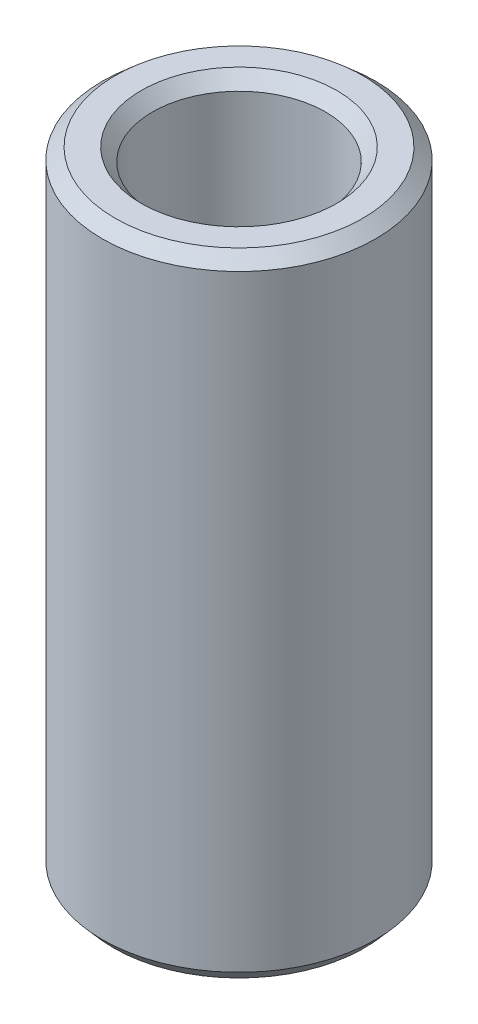
ISO-10303-21;
HEADER;
FILE_DESCRIPTION(('STEP AP214'),'2;1');
FILE_NAME('part.step','',(''),(''),'','','');
FILE_SCHEMA(('AUTOMOTIVE_DESIGN { 1 0 10303 214 1 1 1 1 }'));
ENDSEC;
DATA;
#1=APPLICATION_CONTEXT('core data for automotive mechanical design processes');
#2=APPLICATION_PROTOCOL_DEFINITION('international standard','automotive_design',2000,#1);
#3=PRODUCT_CONTEXT('',#1,'mechanical');
#4=PRODUCT('Part','Part','',(#3));
#5=PRODUCT_RELATED_PRODUCT_CATEGORY('part','',(#4));
#6=PRODUCT_DEFINITION_FORMATION('','',#4);
#7=PRODUCT_DEFINITION_CONTEXT('part definition',#1,'design');
#8=PRODUCT_DEFINITION('design','',#6,#7);
#9=PRODUCT_DEFINITION_SHAPE('','',#8);
#10=(LENGTH_UNIT() NAMED_UNIT(*) SI_UNIT(.MILLI.,.METRE.));
#11=(NAMED_UNIT(*) PLANE_ANGLE_UNIT() SI_UNIT($,.RADIAN.));
#12=(NAMED_UNIT(*) SI_UNIT($,.STERADIAN.) SOLID_ANGLE_UNIT());
#13=UNCERTAINTY_MEASURE_WITH_UNIT(LENGTH_MEASURE(1.E-05),#10,'distance_accuracy_value','');
#14=(GEOMETRIC_REPRESENTATION_CONTEXT(3) GLOBAL_UNCERTAINTY_ASSIGNED_CONTEXT((#13)) GLOBAL_UNIT_ASSIGNED_CONTEXT((#10,
#11,#12)) REPRESENTATION_CONTEXT('',''));
#15=CARTESIAN_POINT('',(0.,0.,0.));
#16=DIRECTION('',(0.,0.,1.));
#17=DIRECTION('',(1.,0.,0.));
#18=AXIS2_PLACEMENT_3D('',#15,#16,#17);
#19=CARTESIAN_POINT('',(0.,219.440858252176,0.));
#20=DIRECTION('',(0.,-1.,0.));
#21=DIRECTION('',(0.,0.,-1.));
#22=AXIS2_PLACEMENT_3D('',#19,#20,#21);
#23=CYLINDRICAL_SURFACE('',#22,47.5);
#24=CARTESIAN_POINT('',(0.,4.4820661124276,0.));
#25=DIRECTION('',(0.,1.,0.));
#26=DIRECTION('',(0.,0.,1.));
#27=AXIS2_PLACEMENT_3D('',#24,#25,#26);
#28=CIRCLE('',#27,47.5);
#29=CARTESIAN_POINT('',(0.,4.4820661124276,47.5));
#30=VERTEX_POINT('',#29);
#31=EDGE_CURVE('E10',#30,#30,#28,.T.);
#32=ORIENTED_EDGE('',*,*,#31,.T.);
#33=EDGE_LOOP('',(#32));
#34=FACE_BOUND('',#33,.T.);
#35=CARTESIAN_POINT('',(0.,215.505596652666,0.));
#36=DIRECTION('',(0.,1.,0.));
#37=DIRECTION('',(0.,0.,1.));
#38=AXIS2_PLACEMENT_3D('',#35,#36,#37);
#39=CIRCLE('',#38,47.5);
#40=CARTESIAN_POINT('',(0.,215.505596652666,47.5));
#41=VERTEX_POINT('',#40);
#42=EDGE_CURVE('E50',#41,#41,#39,.F.);
#43=ORIENTED_EDGE('',*,*,#42,.T.);
#44=EDGE_LOOP('',(#43));
#45=FACE_BOUND('',#44,.T.);
#46=ADVANCED_FACE('F39',(#34,#45),#23,.T.);
#47=CARTESIAN_POINT('',(0.,219.440858252176,0.));
#48=DIRECTION('',(0.,1.,0.));
#49=DIRECTION('',(0.,0.,1.));
#50=AXIS2_PLACEMENT_3D('',#47,#48,#49);
#51=PLANE('',#50);
#52=CARTESIAN_POINT('',(0.,219.440858252176,0.));
#53=DIRECTION('',(0.,1.,0.));
#54=DIRECTION('',(0.,0.,1.));
#55=AXIS2_PLACEMENT_3D('',#52,#53,#54);
#56=CIRCLE('',#55,34.0138644032273);
#57=CARTESIAN_POINT('',(0.,219.440858252176,34.0138644032273));
#58=VERTEX_POINT('',#57);
#59=EDGE_CURVE('E58',#58,#58,#56,.F.);
#60=ORIENTED_EDGE('',*,*,#59,.T.);
#61=EDGE_LOOP('',(#60));
#62=FACE_BOUND('',#61,.T.);
#63=CARTESIAN_POINT('',(0.,219.440858252176,0.));
#64=DIRECTION('',(0.,1.,0.));
#65=DIRECTION('',(0.,0.,1.));
#66=AXIS2_PLACEMENT_3D('',#63,#64,#65);
#67=CIRCLE('',#66,43.0179338875724);
#68=CARTESIAN_POINT('',(0.,219.440858252176,43.0179338875724));
#69=VERTEX_POINT('',#68);
#70=EDGE_CURVE('E61',#69,#69,#67,.T.);
#71=ORIENTED_EDGE('',*,*,#70,.T.);
#72=EDGE_LOOP('',(#71));
#73=FACE_BOUND('',#72,.T.);
#74=ADVANCED_FACE('F88',(#62,#73),#51,.T.);
#75=CARTESIAN_POINT('',(0.,0.,0.));
#76=DIRECTION('',(0.,1.,0.));
#77=DIRECTION('',(0.,0.,1.));
#78=AXIS2_PLACEMENT_3D('',#75,#76,#77);
#79=PLANE('',#78);
#80=CARTESIAN_POINT('',(0.,0.,0.));
#81=DIRECTION('',(0.,1.,0.));
#82=DIRECTION('',(0.,0.,1.));
#83=AXIS2_PLACEMENT_3D('',#80,#81,#82);
#84=CIRCLE('',#83,34.5606689161448);
#85=CARTESIAN_POINT('',(0.,0.,34.5606689161448));
#86=VERTEX_POINT('',#85);
#87=EDGE_CURVE('E51',#86,#86,#84,.T.);
#88=ORIENTED_EDGE('',*,*,#87,.T.);
#89=EDGE_LOOP('',(#88));
#90=FACE_BOUND('',#89,.T.);
#91=CARTESIAN_POINT('',(0.,0.,0.));
#92=DIRECTION('',(0.,1.,0.));
#93=DIRECTION('',(0.,0.,1.));
#94=AXIS2_PLACEMENT_3D('',#91,#92,#93);
#95=CIRCLE('',#94,43.5647384004899);
#96=CARTESIAN_POINT('',(0.,0.,43.5647384004899));
#97=VERTEX_POINT('',#96);
#98=EDGE_CURVE('E54',#97,#97,#95,.F.);
#99=ORIENTED_EDGE('',*,*,#98,.T.);
#100=EDGE_LOOP('',(#99));
#101=FACE_BOUND('',#100,.T.);
#102=ADVANCED_FACE('F83',(#90,#101),#79,.F.);
#103=CARTESIAN_POINT('',(0.,219.440858252176,0.));
#104=DIRECTION('',(0.,-1.,0.));
#105=DIRECTION('',(0.,0.,-1.));
#106=AXIS2_PLACEMENT_3D('',#103,#104,#105);
#107=CYLINDRICAL_SURFACE('',#106,30.0786028037172);
#108=CARTESIAN_POINT('',(0.,214.958792139749,0.));
#109=DIRECTION('',(0.,1.,0.));
#110=DIRECTION('',(0.,0.,1.));
#111=AXIS2_PLACEMENT_3D('',#108,#109,#110);
#112=CIRCLE('',#111,30.0786028037172);
#113=CARTESIAN_POINT('',(0.,214.958792139749,30.0786028037172));
#114=VERTEX_POINT('',#113);
#115=EDGE_CURVE('E67',#114,#114,#112,.T.);
#116=ORIENTED_EDGE('',*,*,#115,.T.);
#117=EDGE_LOOP('',(#116));
#118=FACE_BOUND('',#117,.T.);
#119=CARTESIAN_POINT('',(0.,3.93526159951008,0.));
#120=DIRECTION('',(0.,1.,0.));
#121=DIRECTION('',(0.,0.,1.));
#122=AXIS2_PLACEMENT_3D('',#119,#120,#121);
#123=CIRCLE('',#122,30.0786028037172);
#124=CARTESIAN_POINT('',(0.,3.93526159951008,30.0786028037172));
#125=VERTEX_POINT('',#124);
#126=EDGE_CURVE('E69',#125,#125,#123,.F.);
#127=ORIENTED_EDGE('',*,*,#126,.T.);
#128=EDGE_LOOP('',(#127));
#129=FACE_BOUND('',#128,.T.);
#130=ADVANCED_FACE('F71',(#118,#129),#107,.F.);
#131=CARTESIAN_POINT('',(0.,214.958792139749,0.));
#132=DIRECTION('',(0.,1.,0.));
#133=DIRECTION('',(0.,0.,1.));
#134=AXIS2_PLACEMENT_3D('',#131,#132,#133);
#135=CONICAL_SURFACE('',#134,30.0786028037172,0.720527542236716);
#136=ORIENTED_EDGE('',*,*,#59,.F.);
#137=EDGE_LOOP('',(#136));
#138=FACE_BOUND('',#137,.T.);
#139=ORIENTED_EDGE('',*,*,#115,.F.);
#140=EDGE_LOOP('',(#139));
#141=FACE_BOUND('',#140,.T.);
#142=ADVANCED_FACE('F77',(#138,#141),#135,.F.);
#143=CARTESIAN_POINT('',(0.,0.,0.));
#144=DIRECTION('',(0.,-1.,0.));
#145=DIRECTION('',(0.,0.,-1.));
#146=AXIS2_PLACEMENT_3D('',#143,#144,#145);
#147=CONICAL_SURFACE('',#146,34.5606689161448,0.850268784558174);
#148=ORIENTED_EDGE('',*,*,#126,.F.);
#149=EDGE_LOOP('',(#148));
#150=FACE_BOUND('',#149,.T.);
#151=ORIENTED_EDGE('',*,*,#87,.F.);
#152=EDGE_LOOP('',(#151));
#153=FACE_BOUND('',#152,.T.);
#154=ADVANCED_FACE('F73',(#150,#153),#147,.F.);
#155=CARTESIAN_POINT('',(0.,4.4820661124276,0.));
#156=DIRECTION('',(0.,1.,0.));
#157=DIRECTION('',(0.,0.,1.));
#158=AXIS2_PLACEMENT_3D('',#155,#156,#157);
#159=CONICAL_SURFACE('',#158,47.5,0.720527542236721);
#160=ORIENTED_EDGE('',*,*,#98,.F.);
#161=EDGE_LOOP('',(#160));
#162=FACE_BOUND('',#161,.T.);
#163=ORIENTED_EDGE('',*,*,#31,.F.);
#164=EDGE_LOOP('',(#163));
#165=FACE_BOUND('',#164,.T.);
#166=ADVANCED_FACE('F76',(#162,#165),#159,.T.);
#167=CARTESIAN_POINT('',(0.,219.440858252176,0.));
#168=DIRECTION('',(0.,-1.,0.));
#169=DIRECTION('',(0.,0.,-1.));
#170=AXIS2_PLACEMENT_3D('',#167,#168,#169);
#171=CONICAL_SURFACE('',#170,43.0179338875724,0.85026878455817);
#172=ORIENTED_EDGE('',*,*,#42,.F.);
#173=EDGE_LOOP('',(#172));
#174=FACE_BOUND('',#173,.T.);
#175=ORIENTED_EDGE('',*,*,#70,.F.);
#176=EDGE_LOOP('',(#175));
#177=FACE_BOUND('',#176,.T.);
#178=ADVANCED_FACE('F45',(#174,#177),#171,.T.);
#179=CLOSED_SHELL('',(#46,#74,#102,#130,#142,#154,#166,#178));
#180=MANIFOLD_SOLID_BREP('B2',#179);
#181=ADVANCED_BREP_SHAPE_REPRESENTATION('',(#18,#180),#14);
#182=SHAPE_DEFINITION_REPRESENTATION(#9,#181);
ENDSEC;
END-ISO-10303-21;
